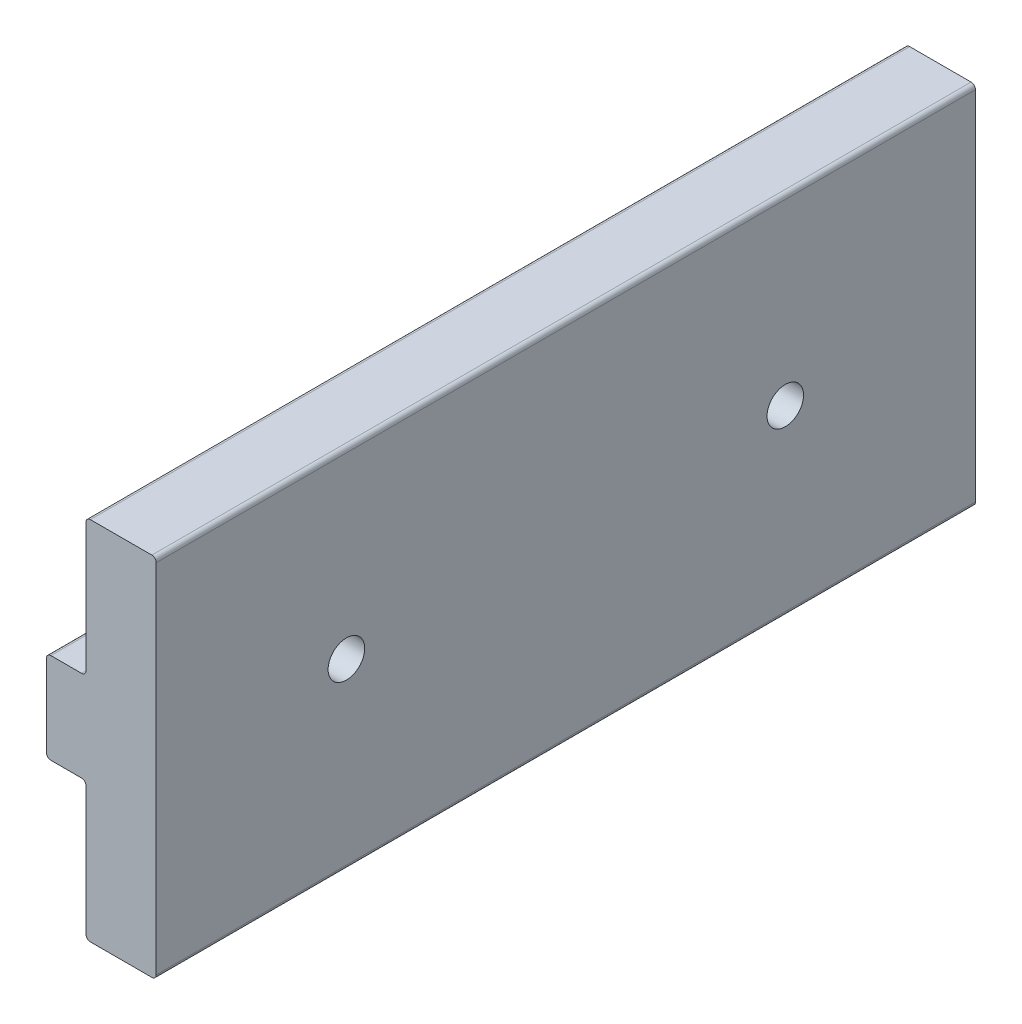
ISO-10303-21;
HEADER;
FILE_DESCRIPTION(('STEP AP214'),'2;1');
FILE_NAME('part.step','',(''),(''),'','','');
FILE_SCHEMA(('AUTOMOTIVE_DESIGN { 1 0 10303 214 1 1 1 1 }'));
ENDSEC;
DATA;
#1=APPLICATION_CONTEXT('core data for automotive mechanical design processes');
#2=APPLICATION_PROTOCOL_DEFINITION('international standard','automotive_design',2000,#1);
#3=PRODUCT_CONTEXT('',#1,'mechanical');
#4=PRODUCT('Part','Part','',(#3));
#5=PRODUCT_RELATED_PRODUCT_CATEGORY('part','',(#4));
#6=PRODUCT_DEFINITION_FORMATION('','',#4);
#7=PRODUCT_DEFINITION_CONTEXT('part definition',#1,'design');
#8=PRODUCT_DEFINITION('design','',#6,#7);
#9=PRODUCT_DEFINITION_SHAPE('','',#8);
#10=(LENGTH_UNIT() NAMED_UNIT(*) SI_UNIT(.MILLI.,.METRE.));
#11=(NAMED_UNIT(*) PLANE_ANGLE_UNIT() SI_UNIT($,.RADIAN.));
#12=(NAMED_UNIT(*) SI_UNIT($,.STERADIAN.) SOLID_ANGLE_UNIT());
#13=UNCERTAINTY_MEASURE_WITH_UNIT(LENGTH_MEASURE(1.E-05),#10,'distance_accuracy_value','');
#14=(GEOMETRIC_REPRESENTATION_CONTEXT(3) GLOBAL_UNCERTAINTY_ASSIGNED_CONTEXT((#13)) GLOBAL_UNIT_ASSIGNED_CONTEXT((#10,
#11,#12)) REPRESENTATION_CONTEXT('',''));
#15=CARTESIAN_POINT('',(0.,0.,0.));
#16=DIRECTION('',(0.,0.,1.));
#17=DIRECTION('',(1.,0.,0.));
#18=AXIS2_PLACEMENT_3D('',#15,#16,#17);
#19=CARTESIAN_POINT('',(-3.04800000000016,3.55600000000016,35.56));
#20=DIRECTION('',(0.,0.,-1.));
#21=DIRECTION('',(-1.,-2.04281036531029E-13,0.));
#22=AXIS2_PLACEMENT_3D('',#19,#20,#21);
#23=CYLINDRICAL_SURFACE('',#22,0.380999999999846);
#24=CARTESIAN_POINT('',(-3.04800000000016,3.55600000000016,-35.56));
#25=DIRECTION('',(0.,0.,1.));
#26=DIRECTION('',(4.06790378576731E-13,1.,0.));
#27=AXIS2_PLACEMENT_3D('',#24,#25,#26);
#28=CIRCLE('',#27,0.380999999999846);
#29=CARTESIAN_POINT('',(-3.048,3.937,-35.56));
#30=VERTEX_POINT('',#29);
#31=CARTESIAN_POINT('',(-3.429,3.55600000000009,-35.56));
#32=VERTEX_POINT('',#31);
#33=EDGE_CURVE('E130',#30,#32,#28,.T.);
#34=ORIENTED_EDGE('',*,*,#33,.T.);
#35=DIRECTION('',(0.,0.,1.));
#36=VECTOR('',#35,1.);
#37=CARTESIAN_POINT('',(-3.429,3.55600000000009,-35.56));
#38=LINE('',#37,#36);
#39=CARTESIAN_POINT('',(-3.429,3.55600000000008,35.56));
#40=VERTEX_POINT('',#39);
#41=EDGE_CURVE('E144',#40,#32,#38,.F.);
#42=ORIENTED_EDGE('',*,*,#41,.F.);
#43=CARTESIAN_POINT('',(-3.04800000000016,3.55600000000016,35.56));
#44=DIRECTION('',(0.,0.,-1.));
#45=DIRECTION('',(-1.,-2.03977983527014E-13,0.));
#46=AXIS2_PLACEMENT_3D('',#43,#44,#45);
#47=CIRCLE('',#46,0.380999999999846);
#48=CARTESIAN_POINT('',(-3.048,3.937,35.56));
#49=VERTEX_POINT('',#48);
#50=EDGE_CURVE('E151',#49,#40,#47,.F.);
#51=ORIENTED_EDGE('',*,*,#50,.F.);
#52=DIRECTION('',(0.,0.,-1.));
#53=VECTOR('',#52,1.);
#54=CARTESIAN_POINT('',(-3.048,3.937,35.56));
#55=LINE('',#54,#53);
#56=EDGE_CURVE('E138',#49,#30,#55,.T.);
#57=ORIENTED_EDGE('',*,*,#56,.T.);
#58=EDGE_LOOP('',(#34,#42,#51,#57));
#59=FACE_BOUND('',#58,.T.);
#60=ADVANCED_FACE('F17',(#59),#23,.T.);
#61=CARTESIAN_POINT('',(-3.429,-3.55600000000008,35.56));
#62=DIRECTION('',(-1.,0.,0.));
#63=DIRECTION('',(0.,1.,0.));
#64=AXIS2_PLACEMENT_3D('',#61,#62,#63);
#65=PLANE('',#64);
#66=DIRECTION('',(0.,-1.,0.));
#67=VECTOR('',#66,1.);
#68=CARTESIAN_POINT('',(-3.429,3.55600000000009,-35.56));
#69=LINE('',#68,#67);
#70=CARTESIAN_POINT('',(-3.429,-3.556,-35.56));
#71=VERTEX_POINT('',#70);
#72=EDGE_CURVE('E127',#32,#71,#69,.T.);
#73=ORIENTED_EDGE('',*,*,#72,.T.);
#74=DIRECTION('',(0.,0.,1.));
#75=VECTOR('',#74,1.);
#76=CARTESIAN_POINT('',(-3.429,-3.556,-35.56));
#77=LINE('',#76,#75);
#78=CARTESIAN_POINT('',(-3.429,-3.55600000000008,35.56));
#79=VERTEX_POINT('',#78);
#80=EDGE_CURVE('E137',#79,#71,#77,.F.);
#81=ORIENTED_EDGE('',*,*,#80,.F.);
#82=DIRECTION('',(0.,1.,0.));
#83=VECTOR('',#82,1.);
#84=CARTESIAN_POINT('',(-3.429,-3.55600000000008,35.56));
#85=LINE('',#84,#83);
#86=EDGE_CURVE('E150',#40,#79,#85,.F.);
#87=ORIENTED_EDGE('',*,*,#86,.F.);
#88=ORIENTED_EDGE('',*,*,#41,.T.);
#89=EDGE_LOOP('',(#73,#81,#87,#88));
#90=FACE_BOUND('',#89,.T.);
#91=CARTESIAN_POINT('',(-3.429,0.,19.05));
#92=DIRECTION('',(1.,0.,0.));
#93=DIRECTION('',(0.,-1.42054033418165E-07,0.99999999999999));
#94=AXIS2_PLACEMENT_3D('',#91,#92,#93);
#95=CIRCLE('',#94,1.5875);
#96=CARTESIAN_POINT('',(-3.429,-2.25510778051336E-07,20.6375));
#97=VERTEX_POINT('',#96);
#98=EDGE_CURVE('E170',#97,#97,#95,.T.);
#99=ORIENTED_EDGE('',*,*,#98,.T.);
#100=EDGE_LOOP('',(#99));
#101=FACE_BOUND('',#100,.T.);
#102=CARTESIAN_POINT('',(-3.429,0.,-19.05));
#103=DIRECTION('',(1.,0.,0.));
#104=DIRECTION('',(0.,0.,1.));
#105=AXIS2_PLACEMENT_3D('',#102,#103,#104);
#106=CIRCLE('',#105,1.5875);
#107=CARTESIAN_POINT('',(-3.429,0.,-17.4625));
#108=VERTEX_POINT('',#107);
#109=EDGE_CURVE('E175',#108,#108,#106,.T.);
#110=ORIENTED_EDGE('',*,*,#109,.T.);
#111=EDGE_LOOP('',(#110));
#112=FACE_BOUND('',#111,.T.);
#113=ADVANCED_FACE('F148',(#90,#101,#112),#65,.T.);
#114=CARTESIAN_POINT('',(-3.04800000000016,-3.55600000000016,35.56));
#115=DIRECTION('',(0.,0.,-1.));
#116=DIRECTION('',(3.05717073396715E-13,-1.,0.));
#117=AXIS2_PLACEMENT_3D('',#114,#115,#116);
#118=CYLINDRICAL_SURFACE('',#117,0.380999999999846);
#119=CARTESIAN_POINT('',(-3.04800000000016,-3.55600000000016,-35.56));
#120=DIRECTION('',(0.,0.,1.));
#121=DIRECTION('',(-1.,4.03293613144839E-13,0.));
#122=AXIS2_PLACEMENT_3D('',#119,#120,#121);
#123=CIRCLE('',#122,0.380999999999846);
#124=CARTESIAN_POINT('',(-3.04800000000005,-3.937,-35.56));
#125=VERTEX_POINT('',#124);
#126=EDGE_CURVE('E132',#71,#125,#123,.T.);
#127=ORIENTED_EDGE('',*,*,#126,.T.);
#128=DIRECTION('',(0.,0.,1.));
#129=VECTOR('',#128,1.);
#130=CARTESIAN_POINT('',(-3.04800000000005,-3.937,-35.56));
#131=LINE('',#130,#129);
#132=CARTESIAN_POINT('',(-3.04800000000004,-3.937,35.56));
#133=VERTEX_POINT('',#132);
#134=EDGE_CURVE('E179',#133,#125,#131,.F.);
#135=ORIENTED_EDGE('',*,*,#134,.F.);
#136=CARTESIAN_POINT('',(-3.04800000000016,-3.55600000000016,35.56));
#137=DIRECTION('',(0.,0.,-1.));
#138=DIRECTION('',(3.05384181051872E-13,-1.,0.));
#139=AXIS2_PLACEMENT_3D('',#136,#137,#138);
#140=CIRCLE('',#139,0.380999999999846);
#141=EDGE_CURVE('E184',#79,#133,#140,.F.);
#142=ORIENTED_EDGE('',*,*,#141,.F.);
#143=ORIENTED_EDGE('',*,*,#80,.T.);
#144=EDGE_LOOP('',(#127,#135,#142,#143));
#145=FACE_BOUND('',#144,.T.);
#146=ADVANCED_FACE('F417',(#145),#118,.T.);
#147=CARTESIAN_POINT('',(-3.04800000000005,-3.937,-35.56));
#148=DIRECTION('',(0.,-1.,0.));
#149=DIRECTION('',(1.,0.,0.));
#150=AXIS2_PLACEMENT_3D('',#147,#148,#149);
#151=PLANE('',#150);
#152=DIRECTION('',(1.,0.,0.));
#153=VECTOR('',#152,1.);
#154=CARTESIAN_POINT('',(-3.04800000000005,-3.937,-35.56));
#155=LINE('',#154,#153);
#156=CARTESIAN_POINT('',(-0.380999999999992,-3.937,-35.56));
#157=VERTEX_POINT('',#156);
#158=EDGE_CURVE('E188',#125,#157,#155,.T.);
#159=ORIENTED_EDGE('',*,*,#158,.T.);
#160=DIRECTION('',(0.,0.,1.));
#161=VECTOR('',#160,1.);
#162=CARTESIAN_POINT('',(-0.380999999999992,-3.937,-35.56));
#163=LINE('',#162,#161);
#164=CARTESIAN_POINT('',(-0.380999999999982,-3.937,35.56));
#165=VERTEX_POINT('',#164);
#166=EDGE_CURVE('E193',#165,#157,#163,.F.);
#167=ORIENTED_EDGE('',*,*,#166,.F.);
#168=DIRECTION('',(-1.,0.,0.));
#169=VECTOR('',#168,1.);
#170=CARTESIAN_POINT('',(-0.380999999999982,-3.937,35.56));
#171=LINE('',#170,#169);
#172=EDGE_CURVE('E198',#133,#165,#171,.F.);
#173=ORIENTED_EDGE('',*,*,#172,.F.);
#174=ORIENTED_EDGE('',*,*,#134,.T.);
#175=EDGE_LOOP('',(#159,#167,#173,#174));
#176=FACE_BOUND('',#175,.T.);
#177=ADVANCED_FACE('F412',(#176),#151,.T.);
#178=CARTESIAN_POINT('',(-0.380999999999924,-4.31799999999993,35.56));
#179=DIRECTION('',(0.,0.,-1.));
#180=DIRECTION('',(-2.00567510587261E-13,1.,0.));
#181=AXIS2_PLACEMENT_3D('',#178,#179,#180);
#182=CYLINDRICAL_SURFACE('',#181,0.380999999999923);
#183=CARTESIAN_POINT('',(-0.380999999999924,-4.31799999999993,-35.56));
#184=DIRECTION('',(0.,0.,-1.));
#185=DIRECTION('',(-1.80374816861709E-13,1.,0.));
#186=AXIS2_PLACEMENT_3D('',#183,#184,#185);
#187=CIRCLE('',#186,0.380999999999923);
#188=CARTESIAN_POINT('',(0.,-4.31799999999999,-35.56));
#189=VERTEX_POINT('',#188);
#190=EDGE_CURVE('E202',#189,#157,#187,.F.);
#191=ORIENTED_EDGE('',*,*,#190,.F.);
#192=DIRECTION('',(0.,0.,1.));
#193=VECTOR('',#192,1.);
#194=CARTESIAN_POINT('',(0.,-4.31799999999999,-35.56));
#195=LINE('',#194,#193);
#196=CARTESIAN_POINT('',(0.,-4.31799999999998,35.56));
#197=VERTEX_POINT('',#196);
#198=EDGE_CURVE('E206',#197,#189,#195,.F.);
#199=ORIENTED_EDGE('',*,*,#198,.F.);
#200=CARTESIAN_POINT('',(-0.380999999999924,-4.31799999999993,35.56));
#201=DIRECTION('',(0.,0.,1.));
#202=DIRECTION('',(1.,-1.49195325094014E-13,0.));
#203=AXIS2_PLACEMENT_3D('',#200,#201,#202);
#204=CIRCLE('',#203,0.380999999999923);
#205=EDGE_CURVE('E211',#197,#165,#204,.T.);
#206=ORIENTED_EDGE('',*,*,#205,.T.);
#207=ORIENTED_EDGE('',*,*,#166,.T.);
#208=EDGE_LOOP('',(#191,#199,#206,#207));
#209=FACE_BOUND('',#208,.T.);
#210=ADVANCED_FACE('F409',(#209),#182,.F.);
#211=CARTESIAN_POINT('',(0.,-15.494,35.56));
#212=DIRECTION('',(-1.,0.,0.));
#213=DIRECTION('',(0.,1.,0.));
#214=AXIS2_PLACEMENT_3D('',#211,#212,#213);
#215=PLANE('',#214);
#216=DIRECTION('',(0.,-1.,0.));
#217=VECTOR('',#216,1.);
#218=CARTESIAN_POINT('',(0.,-4.31799999999998,-35.56));
#219=LINE('',#218,#217);
#220=CARTESIAN_POINT('',(0.,-15.494,-35.56));
#221=VERTEX_POINT('',#220);
#222=EDGE_CURVE('E216',#189,#221,#219,.T.);
#223=ORIENTED_EDGE('',*,*,#222,.T.);
#224=DIRECTION('',(0.,0.,1.));
#225=VECTOR('',#224,1.);
#226=CARTESIAN_POINT('',(0.,-15.494,-35.56));
#227=LINE('',#226,#225);
#228=CARTESIAN_POINT('',(0.,-15.494,35.56));
#229=VERTEX_POINT('',#228);
#230=EDGE_CURVE('E221',#229,#221,#227,.F.);
#231=ORIENTED_EDGE('',*,*,#230,.F.);
#232=DIRECTION('',(0.,1.,0.));
#233=VECTOR('',#232,1.);
#234=CARTESIAN_POINT('',(0.,-15.494,35.56));
#235=LINE('',#234,#233);
#236=EDGE_CURVE('E226',#197,#229,#235,.F.);
#237=ORIENTED_EDGE('',*,*,#236,.F.);
#238=ORIENTED_EDGE('',*,*,#198,.T.);
#239=EDGE_LOOP('',(#223,#231,#237,#238));
#240=FACE_BOUND('',#239,.T.);
#241=ADVANCED_FACE('F405',(#240),#215,.T.);
#242=CARTESIAN_POINT('',(0.380999999999924,-15.494,35.56));
#243=DIRECTION('',(0.,0.,-1.));
#244=DIRECTION('',(2.009120198721E-13,-1.,0.));
#245=AXIS2_PLACEMENT_3D('',#242,#243,#244);
#246=CYLINDRICAL_SURFACE('',#245,0.380999999999924);
#247=CARTESIAN_POINT('',(0.380999999999924,-15.494,-35.56));
#248=DIRECTION('',(0.,0.,1.));
#249=DIRECTION('',(-1.,0.,0.));
#250=AXIS2_PLACEMENT_3D('',#247,#248,#249);
#251=CIRCLE('',#250,0.380999999999924);
#252=CARTESIAN_POINT('',(0.380999999999978,-15.8749999999999,-35.56));
#253=VERTEX_POINT('',#252);
#254=EDGE_CURVE('E230',#221,#253,#251,.T.);
#255=ORIENTED_EDGE('',*,*,#254,.T.);
#256=DIRECTION('',(0.,0.,1.));
#257=VECTOR('',#256,1.);
#258=CARTESIAN_POINT('',(0.380999999999978,-15.8749999999999,-35.56));
#259=LINE('',#258,#257);
#260=CARTESIAN_POINT('',(0.380999999999981,-15.8749999999999,35.56));
#261=VERTEX_POINT('',#260);
#262=EDGE_CURVE('E235',#261,#253,#259,.F.);
#263=ORIENTED_EDGE('',*,*,#262,.F.);
#264=CARTESIAN_POINT('',(0.380999999999924,-15.494,35.56));
#265=DIRECTION('',(0.,0.,-1.));
#266=DIRECTION('',(1.51235104929284E-13,-1.,0.));
#267=AXIS2_PLACEMENT_3D('',#264,#265,#266);
#268=CIRCLE('',#267,0.380999999999924);
#269=EDGE_CURVE('E240',#229,#261,#268,.F.);
#270=ORIENTED_EDGE('',*,*,#269,.F.);
#271=ORIENTED_EDGE('',*,*,#230,.T.);
#272=EDGE_LOOP('',(#255,#263,#270,#271));
#273=FACE_BOUND('',#272,.T.);
#274=ADVANCED_FACE('F401',(#273),#246,.T.);
#275=CARTESIAN_POINT('',(0.380999999999978,-15.875,-35.56));
#276=DIRECTION('',(0.,-1.,0.));
#277=DIRECTION('',(1.,0.,0.));
#278=AXIS2_PLACEMENT_3D('',#275,#276,#277);
#279=PLANE('',#278);
#280=DIRECTION('',(1.,0.,0.));
#281=VECTOR('',#280,1.);
#282=CARTESIAN_POINT('',(0.380999999999978,-15.875,-35.56));
#283=LINE('',#282,#281);
#284=CARTESIAN_POINT('',(5.715,-15.875,-35.56));
#285=VERTEX_POINT('',#284);
#286=EDGE_CURVE('E244',#253,#285,#283,.T.);
#287=ORIENTED_EDGE('',*,*,#286,.T.);
#288=DIRECTION('',(0.,0.,1.));
#289=VECTOR('',#288,1.);
#290=CARTESIAN_POINT('',(5.715,-15.875,-35.56));
#291=LINE('',#290,#289);
#292=CARTESIAN_POINT('',(5.715,-15.875,35.56));
#293=VERTEX_POINT('',#292);
#294=EDGE_CURVE('E249',#293,#285,#291,.F.);
#295=ORIENTED_EDGE('',*,*,#294,.F.);
#296=DIRECTION('',(-1.,0.,0.));
#297=VECTOR('',#296,1.);
#298=CARTESIAN_POINT('',(5.715,-15.875,35.56));
#299=LINE('',#298,#297);
#300=EDGE_CURVE('E254',#261,#293,#299,.F.);
#301=ORIENTED_EDGE('',*,*,#300,.F.);
#302=ORIENTED_EDGE('',*,*,#262,.T.);
#303=EDGE_LOOP('',(#287,#295,#301,#302));
#304=FACE_BOUND('',#303,.T.);
#305=ADVANCED_FACE('F396',(#304),#279,.T.);
#306=CARTESIAN_POINT('',(5.71500000000016,-15.494,35.56));
#307=DIRECTION('',(0.,0.,-1.));
#308=DIRECTION('',(1.,0.,0.));
#309=AXIS2_PLACEMENT_3D('',#306,#307,#308);
#310=CYLINDRICAL_SURFACE('',#309,0.380999999999847);
#311=CARTESIAN_POINT('',(5.71500000000016,-15.494,-35.56));
#312=DIRECTION('',(0.,0.,1.));
#313=DIRECTION('',(-4.19611851826999E-13,-1.,0.));
#314=AXIS2_PLACEMENT_3D('',#311,#312,#313);
#315=CIRCLE('',#314,0.380999999999847);
#316=CARTESIAN_POINT('',(6.09600000000001,-15.494,-35.56));
#317=VERTEX_POINT('',#316);
#318=EDGE_CURVE('E258',#285,#317,#315,.T.);
#319=ORIENTED_EDGE('',*,*,#318,.T.);
#320=DIRECTION('',(0.,0.,1.));
#321=VECTOR('',#320,1.);
#322=CARTESIAN_POINT('',(6.09600000000001,-15.494,-35.56));
#323=LINE('',#322,#321);
#324=CARTESIAN_POINT('',(6.09600000000001,-15.494,35.56));
#325=VERTEX_POINT('',#324);
#326=EDGE_CURVE('E263',#325,#317,#323,.F.);
#327=ORIENTED_EDGE('',*,*,#326,.F.);
#328=CARTESIAN_POINT('',(5.71500000000016,-15.494,35.56));
#329=DIRECTION('',(0.,0.,-1.));
#330=DIRECTION('',(1.,0.,0.));
#331=AXIS2_PLACEMENT_3D('',#328,#329,#330);
#332=CIRCLE('',#331,0.380999999999847);
#333=EDGE_CURVE('E268',#293,#325,#332,.F.);
#334=ORIENTED_EDGE('',*,*,#333,.F.);
#335=ORIENTED_EDGE('',*,*,#294,.T.);
#336=EDGE_LOOP('',(#319,#327,#334,#335));
#337=FACE_BOUND('',#336,.T.);
#338=ADVANCED_FACE('F393',(#337),#310,.T.);
#339=CARTESIAN_POINT('',(6.096,-15.494,-35.56));
#340=DIRECTION('',(1.,0.,0.));
#341=DIRECTION('',(0.,1.,0.));
#342=AXIS2_PLACEMENT_3D('',#339,#340,#341);
#343=PLANE('',#342);
#344=DIRECTION('',(0.,1.,0.));
#345=VECTOR('',#344,1.);
#346=CARTESIAN_POINT('',(6.096,-15.494,-35.56));
#347=LINE('',#346,#345);
#348=CARTESIAN_POINT('',(6.096,15.494,-35.56));
#349=VERTEX_POINT('',#348);
#350=EDGE_CURVE('E272',#317,#349,#347,.T.);
#351=ORIENTED_EDGE('',*,*,#350,.T.);
#352=DIRECTION('',(0.,0.,1.));
#353=VECTOR('',#352,1.);
#354=CARTESIAN_POINT('',(6.096,15.494,-35.56));
#355=LINE('',#354,#353);
#356=CARTESIAN_POINT('',(6.096,15.494,35.56));
#357=VERTEX_POINT('',#356);
#358=EDGE_CURVE('E277',#357,#349,#355,.F.);
#359=ORIENTED_EDGE('',*,*,#358,.F.);
#360=DIRECTION('',(0.,-1.,0.));
#361=VECTOR('',#360,1.);
#362=CARTESIAN_POINT('',(6.096,15.494,35.56));
#363=LINE('',#362,#361);
#364=EDGE_CURVE('E282',#325,#357,#363,.F.);
#365=ORIENTED_EDGE('',*,*,#364,.F.);
#366=ORIENTED_EDGE('',*,*,#326,.T.);
#367=EDGE_LOOP('',(#351,#359,#365,#366));
#368=FACE_BOUND('',#367,.T.);
#369=CARTESIAN_POINT('',(6.096,0.,19.05));
#370=DIRECTION('',(-1.,0.,0.));
#371=DIRECTION('',(0.,0.,-1.));
#372=AXIS2_PLACEMENT_3D('',#369,#370,#371);
#373=CIRCLE('',#372,1.5875);
#374=CARTESIAN_POINT('',(6.096,0.,17.4625));
#375=VERTEX_POINT('',#374);
#376=EDGE_CURVE('E286',#375,#375,#373,.F.);
#377=ORIENTED_EDGE('',*,*,#376,.F.);
#378=EDGE_LOOP('',(#377));
#379=FACE_BOUND('',#378,.T.);
#380=CARTESIAN_POINT('',(6.096,0.,-19.05));
#381=DIRECTION('',(-1.,0.,0.));
#382=DIRECTION('',(0.,0.,-1.));
#383=AXIS2_PLACEMENT_3D('',#380,#381,#382);
#384=CIRCLE('',#383,1.5875);
#385=CARTESIAN_POINT('',(6.096,0.,-20.6375));
#386=VERTEX_POINT('',#385);
#387=EDGE_CURVE('E291',#386,#386,#384,.F.);
#388=ORIENTED_EDGE('',*,*,#387,.F.);
#389=EDGE_LOOP('',(#388));
#390=FACE_BOUND('',#389,.T.);
#391=ADVANCED_FACE('F387',(#368,#379,#390),#343,.T.);
#392=CARTESIAN_POINT('',(5.71500000000016,15.494,35.56));
#393=DIRECTION('',(0.,0.,-1.));
#394=DIRECTION('',(-3.14698437518727E-13,1.,0.));
#395=AXIS2_PLACEMENT_3D('',#392,#393,#394);
#396=CYLINDRICAL_SURFACE('',#395,0.380999999999844);
#397=CARTESIAN_POINT('',(5.71500000000016,15.494,-35.56));
#398=DIRECTION('',(0.,0.,1.));
#399=DIRECTION('',(1.,0.,0.));
#400=AXIS2_PLACEMENT_3D('',#397,#398,#399);
#401=CIRCLE('',#400,0.380999999999844);
#402=CARTESIAN_POINT('',(5.71500000000005,15.8749999999998,-35.56));
#403=VERTEX_POINT('',#402);
#404=EDGE_CURVE('E294',#349,#403,#401,.T.);
#405=ORIENTED_EDGE('',*,*,#404,.T.);
#406=DIRECTION('',(0.,0.,1.));
#407=VECTOR('',#406,1.);
#408=CARTESIAN_POINT('',(5.71500000000005,15.8749999999998,-35.56));
#409=LINE('',#408,#407);
#410=CARTESIAN_POINT('',(5.71500000000004,15.8749999999998,35.56));
#411=VERTEX_POINT('',#410);
#412=EDGE_CURVE('E297',#411,#403,#409,.F.);
#413=ORIENTED_EDGE('',*,*,#412,.F.);
#414=CARTESIAN_POINT('',(5.71500000000016,15.494,35.56));
#415=DIRECTION('',(0.,0.,-1.));
#416=DIRECTION('',(-3.14708888870252E-13,1.,0.));
#417=AXIS2_PLACEMENT_3D('',#414,#415,#416);
#418=CIRCLE('',#417,0.380999999999844);
#419=EDGE_CURVE('E302',#357,#411,#418,.F.);
#420=ORIENTED_EDGE('',*,*,#419,.F.);
#421=ORIENTED_EDGE('',*,*,#358,.T.);
#422=EDGE_LOOP('',(#405,#413,#420,#421));
#423=FACE_BOUND('',#422,.T.);
#424=ADVANCED_FACE('F384',(#423),#396,.T.);
#425=CARTESIAN_POINT('',(0.381,15.875,35.56));
#426=DIRECTION('',(0.,1.,0.));
#427=DIRECTION('',(1.,0.,0.));
#428=AXIS2_PLACEMENT_3D('',#425,#426,#427);
#429=PLANE('',#428);
#430=DIRECTION('',(-1.,0.,0.));
#431=VECTOR('',#430,1.);
#432=CARTESIAN_POINT('',(5.71500000000005,15.875,-35.56));
#433=LINE('',#432,#431);
#434=CARTESIAN_POINT('',(0.381,15.875,-35.56));
#435=VERTEX_POINT('',#434);
#436=EDGE_CURVE('E306',#403,#435,#433,.T.);
#437=ORIENTED_EDGE('',*,*,#436,.T.);
#438=DIRECTION('',(0.,0.,1.));
#439=VECTOR('',#438,1.);
#440=CARTESIAN_POINT('',(0.381,15.875,-35.56));
#441=LINE('',#440,#439);
#442=CARTESIAN_POINT('',(0.381,15.875,35.56));
#443=VERTEX_POINT('',#442);
#444=EDGE_CURVE('E311',#443,#435,#441,.F.);
#445=ORIENTED_EDGE('',*,*,#444,.F.);
#446=DIRECTION('',(1.,0.,0.));
#447=VECTOR('',#446,1.);
#448=CARTESIAN_POINT('',(0.381,15.875,35.56));
#449=LINE('',#448,#447);
#450=EDGE_CURVE('E316',#411,#443,#449,.F.);
#451=ORIENTED_EDGE('',*,*,#450,.F.);
#452=ORIENTED_EDGE('',*,*,#412,.T.);
#453=EDGE_LOOP('',(#437,#445,#451,#452));
#454=FACE_BOUND('',#453,.T.);
#455=ADVANCED_FACE('F379',(#454),#429,.T.);
#456=CARTESIAN_POINT('',(0.380999999999918,15.494,35.56));
#457=DIRECTION('',(0.,0.,-1.));
#458=DIRECTION('',(-1.,0.,0.));
#459=AXIS2_PLACEMENT_3D('',#456,#457,#458);
#460=CYLINDRICAL_SURFACE('',#459,0.380999999999918);
#461=CARTESIAN_POINT('',(0.380999999999918,15.494,-35.56));
#462=DIRECTION('',(0.,0.,1.));
#463=DIRECTION('',(2.14759676941973E-13,1.,0.));
#464=AXIS2_PLACEMENT_3D('',#461,#462,#463);
#465=CIRCLE('',#464,0.380999999999918);
#466=CARTESIAN_POINT('',(0.,15.494,-35.56));
#467=VERTEX_POINT('',#466);
#468=EDGE_CURVE('E320',#435,#467,#465,.T.);
#469=ORIENTED_EDGE('',*,*,#468,.T.);
#470=DIRECTION('',(0.,0.,1.));
#471=VECTOR('',#470,1.);
#472=CARTESIAN_POINT('',(0.,15.494,-35.56));
#473=LINE('',#472,#471);
#474=CARTESIAN_POINT('',(0.,15.494,35.56));
#475=VERTEX_POINT('',#474);
#476=EDGE_CURVE('E325',#475,#467,#473,.F.);
#477=ORIENTED_EDGE('',*,*,#476,.F.);
#478=CARTESIAN_POINT('',(0.380999999999918,15.494,35.56));
#479=DIRECTION('',(0.,0.,-1.));
#480=DIRECTION('',(-1.,0.,0.));
#481=AXIS2_PLACEMENT_3D('',#478,#479,#480);
#482=CIRCLE('',#481,0.380999999999918);
#483=EDGE_CURVE('E330',#443,#475,#482,.F.);
#484=ORIENTED_EDGE('',*,*,#483,.F.);
#485=ORIENTED_EDGE('',*,*,#444,.T.);
#486=EDGE_LOOP('',(#469,#477,#484,#485));
#487=FACE_BOUND('',#486,.T.);
#488=ADVANCED_FACE('F376',(#487),#460,.T.);
#489=CARTESIAN_POINT('',(0.,4.31799999999998,35.56));
#490=DIRECTION('',(-1.,0.,0.));
#491=DIRECTION('',(0.,1.,0.));
#492=AXIS2_PLACEMENT_3D('',#489,#490,#491);
#493=PLANE('',#492);
#494=DIRECTION('',(0.,-1.,0.));
#495=VECTOR('',#494,1.);
#496=CARTESIAN_POINT('',(0.,15.494,-35.56));
#497=LINE('',#496,#495);
#498=CARTESIAN_POINT('',(0.,4.318,-35.56));
#499=VERTEX_POINT('',#498);
#500=EDGE_CURVE('E334',#467,#499,#497,.T.);
#501=ORIENTED_EDGE('',*,*,#500,.T.);
#502=DIRECTION('',(0.,0.,1.));
#503=VECTOR('',#502,1.);
#504=CARTESIAN_POINT('',(0.,4.318,-35.56));
#505=LINE('',#504,#503);
#506=CARTESIAN_POINT('',(0.,4.31799999999998,35.56));
#507=VERTEX_POINT('',#506);
#508=EDGE_CURVE('E339',#507,#499,#505,.F.);
#509=ORIENTED_EDGE('',*,*,#508,.F.);
#510=DIRECTION('',(0.,1.,0.));
#511=VECTOR('',#510,1.);
#512=CARTESIAN_POINT('',(0.,4.31799999999998,35.56));
#513=LINE('',#512,#511);
#514=EDGE_CURVE('E344',#475,#507,#513,.F.);
#515=ORIENTED_EDGE('',*,*,#514,.F.);
#516=ORIENTED_EDGE('',*,*,#476,.T.);
#517=EDGE_LOOP('',(#501,#509,#515,#516));
#518=FACE_BOUND('',#517,.T.);
#519=ADVANCED_FACE('F371',(#518),#493,.T.);
#520=CARTESIAN_POINT('',(-0.380999999999924,4.31799999999993,35.56));
#521=DIRECTION('',(0.,0.,-1.));
#522=DIRECTION('',(1.,1.95521717013942E-13,0.));
#523=AXIS2_PLACEMENT_3D('',#520,#521,#522);
#524=CYLINDRICAL_SURFACE('',#523,0.380999999999924);
#525=CARTESIAN_POINT('',(-0.380999999999924,4.31799999999993,-35.56));
#526=DIRECTION('',(0.,0.,-1.));
#527=DIRECTION('',(1.,1.84162979412924E-13,0.));
#528=AXIS2_PLACEMENT_3D('',#525,#526,#527);
#529=CIRCLE('',#528,0.380999999999924);
#530=CARTESIAN_POINT('',(-0.381,3.937,-35.56));
#531=VERTEX_POINT('',#530);
#532=EDGE_CURVE('E348',#531,#499,#529,.F.);
#533=ORIENTED_EDGE('',*,*,#532,.F.);
#534=DIRECTION('',(0.,0.,1.));
#535=VECTOR('',#534,1.);
#536=CARTESIAN_POINT('',(-0.381,3.937,-35.56));
#537=LINE('',#536,#535);
#538=CARTESIAN_POINT('',(-0.381,3.937,35.56));
#539=VERTEX_POINT('',#538);
#540=EDGE_CURVE('E352',#539,#531,#537,.F.);
#541=ORIENTED_EDGE('',*,*,#540,.F.);
#542=CARTESIAN_POINT('',(-0.380999999999924,4.31799999999993,35.56));
#543=DIRECTION('',(0.,0.,1.));
#544=DIRECTION('',(-1.99607026737109E-13,-1.,0.));
#545=AXIS2_PLACEMENT_3D('',#542,#543,#544);
#546=CIRCLE('',#545,0.380999999999924);
#547=EDGE_CURVE('E32',#539,#507,#546,.T.);
#548=ORIENTED_EDGE('',*,*,#547,.T.);
#549=ORIENTED_EDGE('',*,*,#508,.T.);
#550=EDGE_LOOP('',(#533,#541,#548,#549));
#551=FACE_BOUND('',#550,.T.);
#552=ADVANCED_FACE('F368',(#551),#524,.F.);
#553=CARTESIAN_POINT('',(-3.048,3.937,35.56));
#554=DIRECTION('',(0.,1.,0.));
#555=DIRECTION('',(1.,0.,0.));
#556=AXIS2_PLACEMENT_3D('',#553,#554,#555);
#557=PLANE('',#556);
#558=DIRECTION('',(-1.,0.,0.));
#559=VECTOR('',#558,1.);
#560=CARTESIAN_POINT('',(-0.381,3.937,-35.56));
#561=LINE('',#560,#559);
#562=EDGE_CURVE('E26',#531,#30,#561,.T.);
#563=ORIENTED_EDGE('',*,*,#562,.T.);
#564=ORIENTED_EDGE('',*,*,#56,.F.);
#565=DIRECTION('',(1.,0.,0.));
#566=VECTOR('',#565,1.);
#567=CARTESIAN_POINT('',(-3.048,3.937,35.56));
#568=LINE('',#567,#566);
#569=EDGE_CURVE('E11',#539,#49,#568,.F.);
#570=ORIENTED_EDGE('',*,*,#569,.F.);
#571=ORIENTED_EDGE('',*,*,#540,.T.);
#572=EDGE_LOOP('',(#563,#564,#570,#571));
#573=FACE_BOUND('',#572,.T.);
#574=ADVANCED_FACE('F365',(#573),#557,.T.);
#575=CARTESIAN_POINT('',(-3.42900000000002,-15.875,35.56));
#576=DIRECTION('',(0.,0.,1.));
#577=DIRECTION('',(1.,0.,0.));
#578=AXIS2_PLACEMENT_3D('',#575,#576,#577);
#579=PLANE('',#578);
#580=ORIENTED_EDGE('',*,*,#50,.T.);
#581=ORIENTED_EDGE('',*,*,#86,.T.);
#582=ORIENTED_EDGE('',*,*,#141,.T.);
#583=ORIENTED_EDGE('',*,*,#172,.T.);
#584=ORIENTED_EDGE('',*,*,#205,.F.);
#585=ORIENTED_EDGE('',*,*,#236,.T.);
#586=ORIENTED_EDGE('',*,*,#269,.T.);
#587=ORIENTED_EDGE('',*,*,#300,.T.);
#588=ORIENTED_EDGE('',*,*,#333,.T.);
#589=ORIENTED_EDGE('',*,*,#364,.T.);
#590=ORIENTED_EDGE('',*,*,#419,.T.);
#591=ORIENTED_EDGE('',*,*,#450,.T.);
#592=ORIENTED_EDGE('',*,*,#483,.T.);
#593=ORIENTED_EDGE('',*,*,#514,.T.);
#594=ORIENTED_EDGE('',*,*,#547,.F.);
#595=ORIENTED_EDGE('',*,*,#569,.T.);
#596=EDGE_LOOP('',(#580,#581,#582,#583,#584,#585,#586,#587,#588,#589,#590,#591,#592,#593,#594,#595));
#597=FACE_BOUND('',#596,.T.);
#598=ADVANCED_FACE('F418',(#597),#579,.T.);
#599=CARTESIAN_POINT('',(-3.42900000000002,-15.875,-35.56));
#600=DIRECTION('',(0.,0.,-1.));
#601=DIRECTION('',(0.,1.,0.));
#602=AXIS2_PLACEMENT_3D('',#599,#600,#601);
#603=PLANE('',#602);
#604=ORIENTED_EDGE('',*,*,#33,.F.);
#605=ORIENTED_EDGE('',*,*,#562,.F.);
#606=ORIENTED_EDGE('',*,*,#532,.T.);
#607=ORIENTED_EDGE('',*,*,#500,.F.);
#608=ORIENTED_EDGE('',*,*,#468,.F.);
#609=ORIENTED_EDGE('',*,*,#436,.F.);
#610=ORIENTED_EDGE('',*,*,#404,.F.);
#611=ORIENTED_EDGE('',*,*,#350,.F.);
#612=ORIENTED_EDGE('',*,*,#318,.F.);
#613=ORIENTED_EDGE('',*,*,#286,.F.);
#614=ORIENTED_EDGE('',*,*,#254,.F.);
#615=ORIENTED_EDGE('',*,*,#222,.F.);
#616=ORIENTED_EDGE('',*,*,#190,.T.);
#617=ORIENTED_EDGE('',*,*,#158,.F.);
#618=ORIENTED_EDGE('',*,*,#126,.F.);
#619=ORIENTED_EDGE('',*,*,#72,.F.);
#620=EDGE_LOOP('',(#604,#605,#606,#607,#608,#609,#610,#611,#612,#613,#614,#615,#616,#617,#618,#619));
#621=FACE_BOUND('',#620,.T.);
#622=ADVANCED_FACE('F129',(#621),#603,.T.);
#623=CARTESIAN_POINT('',(6.096,0.,19.05));
#624=DIRECTION('',(1.,0.,0.));
#625=DIRECTION('',(0.,1.42053791518999E-07,0.99999999999999));
#626=AXIS2_PLACEMENT_3D('',#623,#624,#625);
#627=CYLINDRICAL_SURFACE('',#626,1.5875);
#628=ORIENTED_EDGE('',*,*,#376,.T.);
#629=EDGE_LOOP('',(#628));
#630=FACE_BOUND('',#629,.T.);
#631=ORIENTED_EDGE('',*,*,#98,.F.);
#632=EDGE_LOOP('',(#631));
#633=FACE_BOUND('',#632,.T.);
#634=ADVANCED_FACE('F426',(#630,#633),#627,.F.);
#635=CARTESIAN_POINT('',(6.096,0.,-19.05));
#636=DIRECTION('',(1.,0.,0.));
#637=DIRECTION('',(0.,0.,1.));
#638=AXIS2_PLACEMENT_3D('',#635,#636,#637);
#639=CYLINDRICAL_SURFACE('',#638,1.5875);
#640=ORIENTED_EDGE('',*,*,#387,.T.);
#641=EDGE_LOOP('',(#640));
#642=FACE_BOUND('',#641,.T.);
#643=ORIENTED_EDGE('',*,*,#109,.F.);
#644=EDGE_LOOP('',(#643));
#645=FACE_BOUND('',#644,.T.);
#646=ADVANCED_FACE('F19',(#642,#645),#639,.F.);
#647=CLOSED_SHELL('',(#60,#113,#146,#177,#210,#241,#274,#305,#338,#391,#424,#455,#488,#519,#552,
#574,#598,#622,#634,#646));
#648=MANIFOLD_SOLID_BREP('B1',#647);
#649=ADVANCED_BREP_SHAPE_REPRESENTATION('',(#18,#648),#14);
#650=SHAPE_DEFINITION_REPRESENTATION(#9,#649);
ENDSEC;
END-ISO-10303-21;
